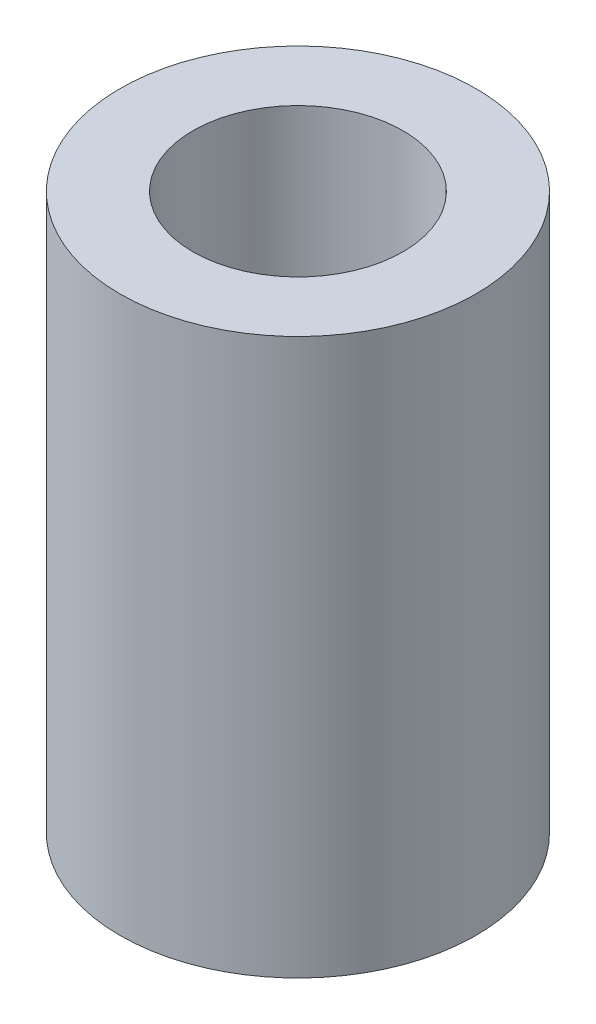
ISO-10303-21;
HEADER;
FILE_DESCRIPTION(('STEP AP214'),'2;1');
FILE_NAME('part.step','',(''),(''),'','','');
FILE_SCHEMA(('AUTOMOTIVE_DESIGN { 1 0 10303 214 1 1 1 1 }'));
ENDSEC;
DATA;
#1=APPLICATION_CONTEXT('core data for automotive mechanical design processes');
#2=APPLICATION_PROTOCOL_DEFINITION('international standard','automotive_design',2000,#1);
#3=PRODUCT_CONTEXT('',#1,'mechanical');
#4=PRODUCT('Part','Part','',(#3));
#5=PRODUCT_RELATED_PRODUCT_CATEGORY('part','',(#4));
#6=PRODUCT_DEFINITION_FORMATION('','',#4);
#7=PRODUCT_DEFINITION_CONTEXT('part definition',#1,'design');
#8=PRODUCT_DEFINITION('design','',#6,#7);
#9=PRODUCT_DEFINITION_SHAPE('','',#8);
#10=(LENGTH_UNIT() NAMED_UNIT(*) SI_UNIT(.MILLI.,.METRE.));
#11=(NAMED_UNIT(*) PLANE_ANGLE_UNIT() SI_UNIT($,.RADIAN.));
#12=(NAMED_UNIT(*) SI_UNIT($,.STERADIAN.) SOLID_ANGLE_UNIT());
#13=UNCERTAINTY_MEASURE_WITH_UNIT(LENGTH_MEASURE(1.E-05),#10,'distance_accuracy_value','');
#14=(GEOMETRIC_REPRESENTATION_CONTEXT(3) GLOBAL_UNCERTAINTY_ASSIGNED_CONTEXT((#13)) GLOBAL_UNIT_ASSIGNED_CONTEXT((#10,
#11,#12)) REPRESENTATION_CONTEXT('',''));
#15=CARTESIAN_POINT('',(0.,0.,0.));
#16=DIRECTION('',(0.,0.,1.));
#17=DIRECTION('',(1.,0.,0.));
#18=AXIS2_PLACEMENT_3D('',#15,#16,#17);
#19=CARTESIAN_POINT('',(0.,19.05,0.));
#20=DIRECTION('',(0.,1.,0.));
#21=DIRECTION('',(0.,0.,1.));
#22=AXIS2_PLACEMENT_3D('',#19,#20,#21);
#23=PLANE('',#22);
#24=CARTESIAN_POINT('',(0.,19.05,0.));
#25=DIRECTION('',(0.,1.,0.));
#26=DIRECTION('',(0.,0.,1.));
#27=AXIS2_PLACEMENT_3D('',#24,#25,#26);
#28=CIRCLE('',#27,6.1);
#29=CARTESIAN_POINT('',(0.,19.05,6.1));
#30=VERTEX_POINT('',#29);
#31=EDGE_CURVE('E10',#30,#30,#28,.T.);
#32=ORIENTED_EDGE('',*,*,#31,.T.);
#33=EDGE_LOOP('',(#32));
#34=FACE_BOUND('',#33,.T.);
#35=CARTESIAN_POINT('',(0.,19.05,0.));
#36=DIRECTION('',(0.,1.,0.));
#37=DIRECTION('',(0.,0.,1.));
#38=AXIS2_PLACEMENT_3D('',#35,#36,#37);
#39=CIRCLE('',#38,3.6);
#40=CARTESIAN_POINT('',(0.,19.05,3.6));
#41=VERTEX_POINT('',#40);
#42=EDGE_CURVE('E48',#41,#41,#39,.T.);
#43=ORIENTED_EDGE('',*,*,#42,.F.);
#44=EDGE_LOOP('',(#43));
#45=FACE_BOUND('',#44,.T.);
#46=ADVANCED_FACE('F37',(#34,#45),#23,.T.);
#47=CARTESIAN_POINT('',(0.,0.,0.));
#48=DIRECTION('',(0.,1.,0.));
#49=DIRECTION('',(0.,0.,1.));
#50=AXIS2_PLACEMENT_3D('',#47,#48,#49);
#51=PLANE('',#50);
#52=CARTESIAN_POINT('',(0.,0.,0.));
#53=DIRECTION('',(0.,1.,0.));
#54=DIRECTION('',(0.,0.,1.));
#55=AXIS2_PLACEMENT_3D('',#52,#53,#54);
#56=CIRCLE('',#55,6.1);
#57=CARTESIAN_POINT('',(0.,0.,6.1));
#58=VERTEX_POINT('',#57);
#59=EDGE_CURVE('E41',#58,#58,#56,.T.);
#60=ORIENTED_EDGE('',*,*,#59,.F.);
#61=EDGE_LOOP('',(#60));
#62=FACE_BOUND('',#61,.T.);
#63=CARTESIAN_POINT('',(0.,0.,0.));
#64=DIRECTION('',(0.,1.,0.));
#65=DIRECTION('',(0.,0.,1.));
#66=AXIS2_PLACEMENT_3D('',#63,#64,#65);
#67=CIRCLE('',#66,3.6);
#68=CARTESIAN_POINT('',(0.,0.,3.6));
#69=VERTEX_POINT('',#68);
#70=EDGE_CURVE('E50',#69,#69,#67,.T.);
#71=ORIENTED_EDGE('',*,*,#70,.T.);
#72=EDGE_LOOP('',(#71));
#73=FACE_BOUND('',#72,.T.);
#74=ADVANCED_FACE('F60',(#62,#73),#51,.F.);
#75=CARTESIAN_POINT('',(0.,19.05,0.));
#76=DIRECTION('',(0.,-1.,0.));
#77=DIRECTION('',(0.,0.,-1.));
#78=AXIS2_PLACEMENT_3D('',#75,#76,#77);
#79=CYLINDRICAL_SURFACE('',#78,6.1);
#80=ORIENTED_EDGE('',*,*,#31,.F.);
#81=EDGE_LOOP('',(#80));
#82=FACE_BOUND('',#81,.T.);
#83=ORIENTED_EDGE('',*,*,#59,.T.);
#84=EDGE_LOOP('',(#83));
#85=FACE_BOUND('',#84,.T.);
#86=ADVANCED_FACE('F39',(#82,#85),#79,.T.);
#87=CARTESIAN_POINT('',(0.,19.05,0.));
#88=DIRECTION('',(0.,-1.,0.));
#89=DIRECTION('',(0.,0.,-1.));
#90=AXIS2_PLACEMENT_3D('',#87,#88,#89);
#91=CYLINDRICAL_SURFACE('',#90,3.6);
#92=ORIENTED_EDGE('',*,*,#42,.T.);
#93=EDGE_LOOP('',(#92));
#94=FACE_BOUND('',#93,.T.);
#95=ORIENTED_EDGE('',*,*,#70,.F.);
#96=EDGE_LOOP('',(#95));
#97=FACE_BOUND('',#96,.T.);
#98=ADVANCED_FACE('F56',(#94,#97),#91,.F.);
#99=CLOSED_SHELL('',(#46,#74,#86,#98));
#100=MANIFOLD_SOLID_BREP('B2',#99);
#101=ADVANCED_BREP_SHAPE_REPRESENTATION('',(#18,#100),#14);
#102=SHAPE_DEFINITION_REPRESENTATION(#9,#101);
ENDSEC;
END-ISO-10303-21;
